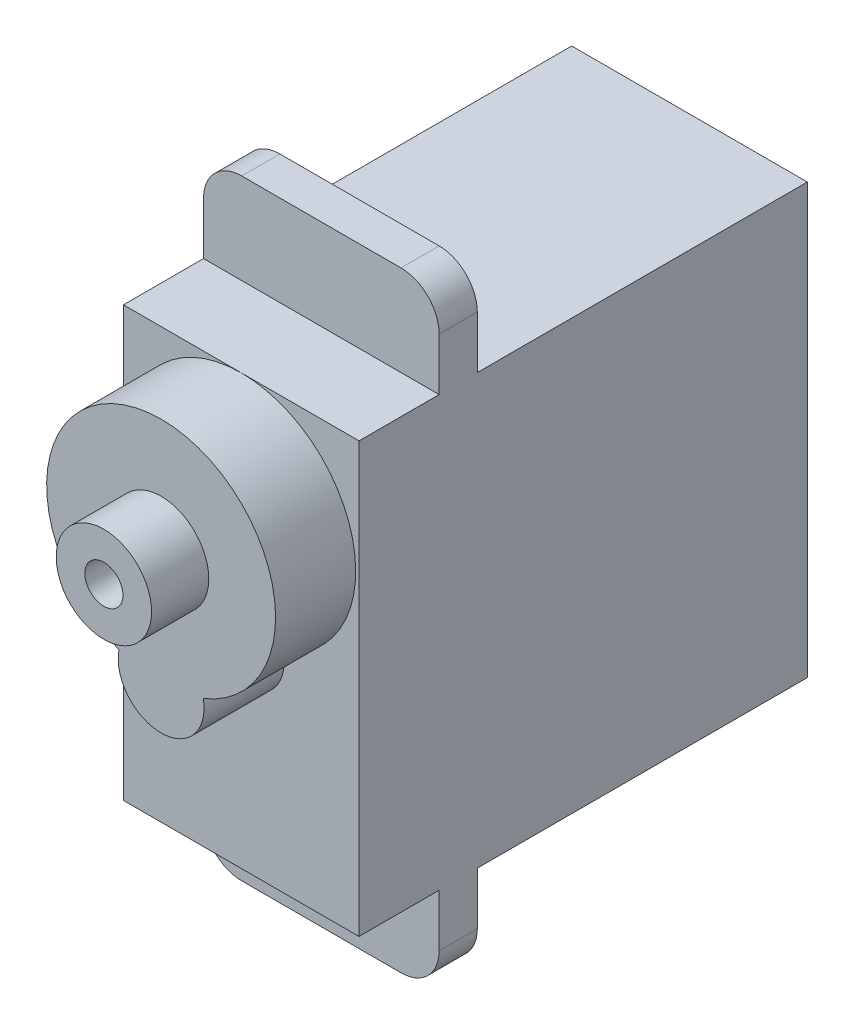
ISO-10303-21;
HEADER;
FILE_DESCRIPTION(('STEP AP214'),'2;1');
FILE_NAME('part.step','',(''),(''),'','','');
FILE_SCHEMA(('AUTOMOTIVE_DESIGN { 1 0 10303 214 1 1 1 1 }'));
ENDSEC;
DATA;
#1=APPLICATION_CONTEXT('core data for automotive mechanical design processes');
#2=APPLICATION_PROTOCOL_DEFINITION('international standard','automotive_design',2000,#1);
#3=PRODUCT_CONTEXT('',#1,'mechanical');
#4=PRODUCT('Part','Part','',(#3));
#5=PRODUCT_RELATED_PRODUCT_CATEGORY('part','',(#4));
#6=PRODUCT_DEFINITION_FORMATION('','',#4);
#7=PRODUCT_DEFINITION_CONTEXT('part definition',#1,'design');
#8=PRODUCT_DEFINITION('design','',#6,#7);
#9=PRODUCT_DEFINITION_SHAPE('','',#8);
#10=(LENGTH_UNIT() NAMED_UNIT(*) SI_UNIT(.MILLI.,.METRE.));
#11=(NAMED_UNIT(*) PLANE_ANGLE_UNIT() SI_UNIT($,.RADIAN.));
#12=(NAMED_UNIT(*) SI_UNIT($,.STERADIAN.) SOLID_ANGLE_UNIT());
#13=UNCERTAINTY_MEASURE_WITH_UNIT(LENGTH_MEASURE(1.E-05),#10,'distance_accuracy_value','');
#14=(GEOMETRIC_REPRESENTATION_CONTEXT(3) GLOBAL_UNCERTAINTY_ASSIGNED_CONTEXT((#13)) GLOBAL_UNIT_ASSIGNED_CONTEXT((#10,
#11,#12)) REPRESENTATION_CONTEXT('',''));
#15=CARTESIAN_POINT('',(0.,0.,0.));
#16=DIRECTION('',(0.,0.,1.));
#17=DIRECTION('',(1.,0.,0.));
#18=AXIS2_PLACEMENT_3D('',#15,#16,#17);
#19=CARTESIAN_POINT('',(6.175,7.58418091123829,178.866706922271));
#20=DIRECTION('',(0.,-1.,0.));
#21=DIRECTION('',(0.,0.,-1.));
#22=AXIS2_PLACEMENT_3D('',#19,#20,#21);
#23=PLANE('',#22);
#24=DIRECTION('',(-1.,0.,0.));
#25=VECTOR('',#24,1.);
#26=CARTESIAN_POINT('',(6.175,7.58418091123829,172.666706922271));
#27=LINE('',#26,#25);
#28=CARTESIAN_POINT('',(6.175,7.5841809112383,172.666706922271));
#29=VERTEX_POINT('',#28);
#30=CARTESIAN_POINT('',(-6.175,7.5841809112383,172.666706922271));
#31=VERTEX_POINT('',#30);
#32=EDGE_CURVE('E230',#29,#31,#27,.T.);
#33=ORIENTED_EDGE('',*,*,#32,.F.);
#34=DIRECTION('',(0.,0.,1.));
#35=VECTOR('',#34,1.);
#36=CARTESIAN_POINT('',(6.175,7.58418091123829,178.866706922271));
#37=LINE('',#36,#35);
#38=CARTESIAN_POINT('',(6.175,7.5841809112383,155.366706922271));
#39=VERTEX_POINT('',#38);
#40=EDGE_CURVE('E234',#39,#29,#37,.T.);
#41=ORIENTED_EDGE('',*,*,#40,.F.);
#42=DIRECTION('',(-1.,0.,0.));
#43=VECTOR('',#42,1.);
#44=CARTESIAN_POINT('',(6.175,7.5841809112383,155.366706922271));
#45=LINE('',#44,#43);
#46=CARTESIAN_POINT('',(-6.175,7.5841809112383,155.366706922271));
#47=VERTEX_POINT('',#46);
#48=EDGE_CURVE('E247',#39,#47,#45,.T.);
#49=ORIENTED_EDGE('',*,*,#48,.T.);
#50=DIRECTION('',(0.,0.,1.));
#51=VECTOR('',#50,1.);
#52=CARTESIAN_POINT('',(-6.175,7.58418091123829,178.866706922271));
#53=LINE('',#52,#51);
#54=EDGE_CURVE('E248',#47,#31,#53,.T.);
#55=ORIENTED_EDGE('',*,*,#54,.T.);
#56=EDGE_LOOP('',(#33,#41,#49,#55));
#57=FACE_BOUND('',#56,.T.);
#58=ADVANCED_FACE('F40',(#57),#23,.F.);
#59=CARTESIAN_POINT('',(6.175,-14.9158190887617,178.866706922271));
#60=DIRECTION('',(0.,1.,0.));
#61=DIRECTION('',(0.,0.,1.));
#62=AXIS2_PLACEMENT_3D('',#59,#60,#61);
#63=PLANE('',#62);
#64=DIRECTION('',(1.,0.,0.));
#65=VECTOR('',#64,1.);
#66=CARTESIAN_POINT('',(6.175,-14.9158190887617,172.666706922271));
#67=LINE('',#66,#65);
#68=CARTESIAN_POINT('',(-6.175,-14.9158190887617,172.666706922271));
#69=VERTEX_POINT('',#68);
#70=CARTESIAN_POINT('',(6.175,-14.9158190887617,172.666706922271));
#71=VERTEX_POINT('',#70);
#72=EDGE_CURVE('E227',#69,#71,#67,.T.);
#73=ORIENTED_EDGE('',*,*,#72,.F.);
#74=DIRECTION('',(0.,0.,-1.));
#75=VECTOR('',#74,1.);
#76=CARTESIAN_POINT('',(-6.175,-14.9158190887617,178.866706922271));
#77=LINE('',#76,#75);
#78=CARTESIAN_POINT('',(-6.175,-14.9158190887617,155.366706922271));
#79=VERTEX_POINT('',#78);
#80=EDGE_CURVE('E253',#69,#79,#77,.T.);
#81=ORIENTED_EDGE('',*,*,#80,.T.);
#82=DIRECTION('',(-1.,0.,0.));
#83=VECTOR('',#82,1.);
#84=CARTESIAN_POINT('',(6.175,-14.9158190887617,155.366706922271));
#85=LINE('',#84,#83);
#86=CARTESIAN_POINT('',(6.175,-14.9158190887617,155.366706922271));
#87=VERTEX_POINT('',#86);
#88=EDGE_CURVE('E262',#87,#79,#85,.T.);
#89=ORIENTED_EDGE('',*,*,#88,.F.);
#90=DIRECTION('',(0.,0.,-1.));
#91=VECTOR('',#90,1.);
#92=CARTESIAN_POINT('',(6.175,-14.9158190887617,178.866706922271));
#93=LINE('',#92,#91);
#94=EDGE_CURVE('E241',#71,#87,#93,.T.);
#95=ORIENTED_EDGE('',*,*,#94,.F.);
#96=EDGE_LOOP('',(#73,#81,#89,#95));
#97=FACE_BOUND('',#96,.T.);
#98=ADVANCED_FACE('F317',(#97),#63,.F.);
#99=CARTESIAN_POINT('',(6.175,7.5841809112383,174.666706922271));
#100=VERTEX_POINT('',#99);
#101=CARTESIAN_POINT('',(6.175,7.58418091123829,178.866706922271));
#102=VERTEX_POINT('',#101);
#103=EDGE_CURVE('E238',#100,#102,#37,.T.);
#104=ORIENTED_EDGE('',*,*,#103,.F.);
#105=DIRECTION('',(-1.,0.,0.));
#106=VECTOR('',#105,1.);
#107=CARTESIAN_POINT('',(6.175,7.58418091123829,174.666706922271));
#108=LINE('',#107,#106);
#109=CARTESIAN_POINT('',(-6.175,7.58418091123829,174.666706922271));
#110=VERTEX_POINT('',#109);
#111=EDGE_CURVE('E224',#100,#110,#108,.T.);
#112=ORIENTED_EDGE('',*,*,#111,.T.);
#113=CARTESIAN_POINT('',(-6.175,7.58418091123829,178.866706922271));
#114=VERTEX_POINT('',#113);
#115=EDGE_CURVE('E233',#110,#114,#53,.T.);
#116=ORIENTED_EDGE('',*,*,#115,.T.);
#117=DIRECTION('',(-1.,0.,0.));
#118=VECTOR('',#117,1.);
#119=CARTESIAN_POINT('',(6.175,7.58418091123829,178.866706922271));
#120=LINE('',#119,#118);
#121=CARTESIAN_POINT('',(0.,7.58418091123829,178.866706922271));
#122=VERTEX_POINT('',#121);
#123=EDGE_CURVE('E269',#122,#114,#120,.T.);
#124=ORIENTED_EDGE('',*,*,#123,.F.);
#125=EDGE_CURVE('E270',#102,#122,#120,.T.);
#126=ORIENTED_EDGE('',*,*,#125,.F.);
#127=EDGE_LOOP('',(#104,#112,#116,#124,#126));
#128=FACE_BOUND('',#127,.T.);
#129=ADVANCED_FACE('F334',(#128),#23,.F.);
#130=CARTESIAN_POINT('',(6.175,7.58418091123829,178.866706922271));
#131=DIRECTION('',(0.,0.,-1.));
#132=DIRECTION('',(-1.,0.,0.));
#133=AXIS2_PLACEMENT_3D('',#130,#131,#132);
#134=PLANE('',#133);
#135=CARTESIAN_POINT('',(0.,-4.41581908876171,178.866706922271));
#136=DIRECTION('',(0.,0.,1.));
#137=DIRECTION('',(1.,0.,0.));
#138=AXIS2_PLACEMENT_3D('',#135,#136,#137);
#139=CIRCLE('',#138,2.25);
#140=CARTESIAN_POINT('',(-2.21009535639868,-3.99394408876171,178.866706922271));
#141=VERTEX_POINT('',#140);
#142=CARTESIAN_POINT('',(2.21009535639868,-3.99394408876171,178.866706922271));
#143=VERTEX_POINT('',#142);
#144=EDGE_CURVE('E189',#141,#143,#139,.T.);
#145=ORIENTED_EDGE('',*,*,#144,.F.);
#146=CARTESIAN_POINT('',(0.,1.58418091123829,178.866706922271));
#147=DIRECTION('',(0.,0.,1.));
#148=DIRECTION('',(1.,0.,0.));
#149=AXIS2_PLACEMENT_3D('',#146,#147,#148);
#150=CIRCLE('',#149,6.);
#151=EDGE_CURVE('E273',#122,#141,#150,.T.);
#152=ORIENTED_EDGE('',*,*,#151,.F.);
#153=ORIENTED_EDGE('',*,*,#123,.T.);
#154=DIRECTION('',(0.,-1.,0.));
#155=VECTOR('',#154,1.);
#156=CARTESIAN_POINT('',(-6.175,7.58418091123829,178.866706922271));
#157=LINE('',#156,#155);
#158=CARTESIAN_POINT('',(-6.175,-14.9158190887617,178.866706922271));
#159=VERTEX_POINT('',#158);
#160=EDGE_CURVE('E251',#114,#159,#157,.T.);
#161=ORIENTED_EDGE('',*,*,#160,.T.);
#162=DIRECTION('',(-1.,0.,0.));
#163=VECTOR('',#162,1.);
#164=CARTESIAN_POINT('',(6.175,-14.9158190887617,178.866706922271));
#165=LINE('',#164,#163);
#166=CARTESIAN_POINT('',(6.175,-14.9158190887617,178.866706922271));
#167=VERTEX_POINT('',#166);
#168=EDGE_CURVE('E266',#167,#159,#165,.T.);
#169=ORIENTED_EDGE('',*,*,#168,.F.);
#170=DIRECTION('',(0.,-1.,0.));
#171=VECTOR('',#170,1.);
#172=CARTESIAN_POINT('',(6.175,7.58418091123829,178.866706922271));
#173=LINE('',#172,#171);
#174=EDGE_CURVE('E237',#102,#167,#173,.T.);
#175=ORIENTED_EDGE('',*,*,#174,.F.);
#176=ORIENTED_EDGE('',*,*,#125,.T.);
#177=EDGE_CURVE('E186',#143,#122,#150,.T.);
#178=ORIENTED_EDGE('',*,*,#177,.F.);
#179=EDGE_LOOP('',(#145,#152,#153,#161,#169,#175,#176,#178));
#180=FACE_BOUND('',#179,.T.);
#181=ADVANCED_FACE('F314',(#180),#134,.F.);
#182=CARTESIAN_POINT('',(-6.175,-14.9158190887617,174.666706922271));
#183=VERTEX_POINT('',#182);
#184=EDGE_CURVE('E254',#159,#183,#77,.T.);
#185=ORIENTED_EDGE('',*,*,#184,.T.);
#186=DIRECTION('',(1.,0.,0.));
#187=VECTOR('',#186,1.);
#188=CARTESIAN_POINT('',(6.175,-14.9158190887617,174.666706922271));
#189=LINE('',#188,#187);
#190=CARTESIAN_POINT('',(6.175,-14.9158190887617,174.666706922271));
#191=VERTEX_POINT('',#190);
#192=EDGE_CURVE('E208',#183,#191,#189,.T.);
#193=ORIENTED_EDGE('',*,*,#192,.T.);
#194=EDGE_CURVE('E242',#167,#191,#93,.T.);
#195=ORIENTED_EDGE('',*,*,#194,.F.);
#196=ORIENTED_EDGE('',*,*,#168,.T.);
#197=EDGE_LOOP('',(#185,#193,#195,#196));
#198=FACE_BOUND('',#197,.T.);
#199=ADVANCED_FACE('F309',(#198),#63,.F.);
#200=CARTESIAN_POINT('',(6.175,7.5841809112383,155.366706922271));
#201=DIRECTION('',(0.,0.,1.));
#202=DIRECTION('',(1.,0.,0.));
#203=AXIS2_PLACEMENT_3D('',#200,#201,#202);
#204=PLANE('',#203);
#205=DIRECTION('',(0.,1.,0.));
#206=VECTOR('',#205,1.);
#207=CARTESIAN_POINT('',(-6.175,7.5841809112383,155.366706922271));
#208=LINE('',#207,#206);
#209=EDGE_CURVE('E257',#79,#47,#208,.T.);
#210=ORIENTED_EDGE('',*,*,#209,.T.);
#211=ORIENTED_EDGE('',*,*,#48,.F.);
#212=DIRECTION('',(0.,1.,0.));
#213=VECTOR('',#212,1.);
#214=CARTESIAN_POINT('',(6.175,7.5841809112383,155.366706922271));
#215=LINE('',#214,#213);
#216=EDGE_CURVE('E245',#87,#39,#215,.T.);
#217=ORIENTED_EDGE('',*,*,#216,.F.);
#218=ORIENTED_EDGE('',*,*,#88,.T.);
#219=EDGE_LOOP('',(#210,#211,#217,#218));
#220=FACE_BOUND('',#219,.T.);
#221=ADVANCED_FACE('F313',(#220),#204,.F.);
#222=CARTESIAN_POINT('',(6.175,0.,0.));
#223=DIRECTION('',(-1.,0.,0.));
#224=DIRECTION('',(0.,0.,1.));
#225=AXIS2_PLACEMENT_3D('',#222,#223,#224);
#226=PLANE('',#225);
#227=DIRECTION('',(0.,1.,0.));
#228=VECTOR('',#227,1.);
#229=CARTESIAN_POINT('',(6.175,12.3341809112383,174.666706922271));
#230=LINE('',#229,#228);
#231=CARTESIAN_POINT('',(6.175,-17.6658190887617,174.666706922271));
#232=VERTEX_POINT('',#231);
#233=EDGE_CURVE('E216',#232,#191,#230,.T.);
#234=ORIENTED_EDGE('',*,*,#233,.F.);
#235=DIRECTION('',(0.,0.,1.));
#236=VECTOR('',#235,1.);
#237=CARTESIAN_POINT('',(6.175,-17.6658190887617,172.666706922271));
#238=LINE('',#237,#236);
#239=CARTESIAN_POINT('',(6.175,-17.6658190887617,172.666706922271));
#240=VERTEX_POINT('',#239);
#241=EDGE_CURVE('E286',#232,#240,#238,.F.);
#242=ORIENTED_EDGE('',*,*,#241,.T.);
#243=DIRECTION('',(0.,1.,0.));
#244=VECTOR('',#243,1.);
#245=CARTESIAN_POINT('',(6.175,12.3341809112383,172.666706922271));
#246=LINE('',#245,#244);
#247=EDGE_CURVE('E205',#240,#71,#246,.T.);
#248=ORIENTED_EDGE('',*,*,#247,.T.);
#249=ORIENTED_EDGE('',*,*,#94,.T.);
#250=ORIENTED_EDGE('',*,*,#216,.T.);
#251=ORIENTED_EDGE('',*,*,#40,.T.);
#252=CARTESIAN_POINT('',(6.175,10.3341809112383,172.666706922271));
#253=VERTEX_POINT('',#252);
#254=EDGE_CURVE('E204',#29,#253,#246,.T.);
#255=ORIENTED_EDGE('',*,*,#254,.T.);
#256=DIRECTION('',(0.,0.,1.));
#257=VECTOR('',#256,1.);
#258=CARTESIAN_POINT('',(6.175,10.3341809112383,174.666706922271));
#259=LINE('',#258,#257);
#260=CARTESIAN_POINT('',(6.175,10.3341809112383,174.666706922271));
#261=VERTEX_POINT('',#260);
#262=EDGE_CURVE('E283',#253,#261,#259,.T.);
#263=ORIENTED_EDGE('',*,*,#262,.T.);
#264=EDGE_CURVE('E215',#100,#261,#230,.T.);
#265=ORIENTED_EDGE('',*,*,#264,.F.);
#266=ORIENTED_EDGE('',*,*,#103,.T.);
#267=ORIENTED_EDGE('',*,*,#174,.T.);
#268=ORIENTED_EDGE('',*,*,#194,.T.);
#269=EDGE_LOOP('',(#234,#242,#248,#249,#250,#251,#255,#263,#265,#266,#267,#268));
#270=FACE_BOUND('',#269,.T.);
#271=ADVANCED_FACE('F351',(#270),#226,.F.);
#272=CARTESIAN_POINT('',(-6.175,0.,0.));
#273=DIRECTION('',(-1.,0.,0.));
#274=DIRECTION('',(0.,0.,1.));
#275=AXIS2_PLACEMENT_3D('',#272,#273,#274);
#276=PLANE('',#275);
#277=DIRECTION('',(0.,-1.,0.));
#278=VECTOR('',#277,1.);
#279=CARTESIAN_POINT('',(-6.175,12.3341809112383,172.666706922271));
#280=LINE('',#279,#278);
#281=CARTESIAN_POINT('',(-6.175,-17.6658190887617,172.666706922271));
#282=VERTEX_POINT('',#281);
#283=EDGE_CURVE('E201',#69,#282,#280,.T.);
#284=ORIENTED_EDGE('',*,*,#283,.T.);
#285=DIRECTION('',(0.,0.,1.));
#286=VECTOR('',#285,1.);
#287=CARTESIAN_POINT('',(-6.175,-17.6658190887617,0.));
#288=LINE('',#287,#286);
#289=CARTESIAN_POINT('',(-6.175,-17.6658190887617,174.666706922271));
#290=VERTEX_POINT('',#289);
#291=EDGE_CURVE('E294',#282,#290,#288,.T.);
#292=ORIENTED_EDGE('',*,*,#291,.T.);
#293=DIRECTION('',(0.,-1.,0.));
#294=VECTOR('',#293,1.);
#295=CARTESIAN_POINT('',(-6.175,12.3341809112383,174.666706922271));
#296=LINE('',#295,#294);
#297=EDGE_CURVE('E190',#183,#290,#296,.T.);
#298=ORIENTED_EDGE('',*,*,#297,.F.);
#299=ORIENTED_EDGE('',*,*,#184,.F.);
#300=ORIENTED_EDGE('',*,*,#160,.F.);
#301=ORIENTED_EDGE('',*,*,#115,.F.);
#302=CARTESIAN_POINT('',(-6.175,10.3341809112383,174.666706922271));
#303=VERTEX_POINT('',#302);
#304=EDGE_CURVE('E193',#303,#110,#296,.T.);
#305=ORIENTED_EDGE('',*,*,#304,.F.);
#306=DIRECTION('',(0.,0.,1.));
#307=VECTOR('',#306,1.);
#308=CARTESIAN_POINT('',(-6.175,10.3341809112383,0.));
#309=LINE('',#308,#307);
#310=CARTESIAN_POINT('',(-6.175,10.3341809112383,172.666706922271));
#311=VERTEX_POINT('',#310);
#312=EDGE_CURVE('E292',#303,#311,#309,.F.);
#313=ORIENTED_EDGE('',*,*,#312,.T.);
#314=EDGE_CURVE('E198',#311,#31,#280,.T.);
#315=ORIENTED_EDGE('',*,*,#314,.T.);
#316=ORIENTED_EDGE('',*,*,#54,.F.);
#317=ORIENTED_EDGE('',*,*,#209,.F.);
#318=ORIENTED_EDGE('',*,*,#80,.F.);
#319=EDGE_LOOP('',(#284,#292,#298,#299,#300,#301,#305,#313,#315,#316,#317,#318));
#320=FACE_BOUND('',#319,.T.);
#321=ADVANCED_FACE('F355',(#320),#276,.T.);
#322=CARTESIAN_POINT('',(-6.175,-19.6658190887617,172.666706922271));
#323=DIRECTION('',(0.,-1.,0.));
#324=DIRECTION('',(1.,0.,0.));
#325=AXIS2_PLACEMENT_3D('',#322,#323,#324);
#326=PLANE('',#325);
#327=DIRECTION('',(1.,0.,0.));
#328=VECTOR('',#327,1.);
#329=CARTESIAN_POINT('',(-6.175,-19.6658190887617,172.666706922271));
#330=LINE('',#329,#328);
#331=CARTESIAN_POINT('',(-4.175,-19.6658190887617,172.666706922271));
#332=VERTEX_POINT('',#331);
#333=CARTESIAN_POINT('',(4.175,-19.6658190887617,172.666706922271));
#334=VERTEX_POINT('',#333);
#335=EDGE_CURVE('E200',#332,#334,#330,.T.);
#336=ORIENTED_EDGE('',*,*,#335,.T.);
#337=DIRECTION('',(0.,0.,1.));
#338=VECTOR('',#337,1.);
#339=CARTESIAN_POINT('',(4.175,-19.6658190887617,174.666706922271));
#340=LINE('',#339,#338);
#341=CARTESIAN_POINT('',(4.175,-19.6658190887617,174.666706922271));
#342=VERTEX_POINT('',#341);
#343=EDGE_CURVE('E276',#334,#342,#340,.T.);
#344=ORIENTED_EDGE('',*,*,#343,.T.);
#345=DIRECTION('',(1.,0.,0.));
#346=VECTOR('',#345,1.);
#347=CARTESIAN_POINT('',(-6.175,-19.6658190887617,174.666706922271));
#348=LINE('',#347,#346);
#349=CARTESIAN_POINT('',(-4.175,-19.6658190887617,174.666706922271));
#350=VERTEX_POINT('',#349);
#351=EDGE_CURVE('E211',#350,#342,#348,.T.);
#352=ORIENTED_EDGE('',*,*,#351,.F.);
#353=DIRECTION('',(0.,0.,1.));
#354=VECTOR('',#353,1.);
#355=CARTESIAN_POINT('',(-4.175,-19.6658190887617,172.666706922271));
#356=LINE('',#355,#354);
#357=EDGE_CURVE('E274',#350,#332,#356,.F.);
#358=ORIENTED_EDGE('',*,*,#357,.T.);
#359=EDGE_LOOP('',(#336,#344,#352,#358));
#360=FACE_BOUND('',#359,.T.);
#361=ADVANCED_FACE('F375',(#360),#326,.T.);
#362=CARTESIAN_POINT('',(0.,0.,172.666706922271));
#363=DIRECTION('',(0.,0.,1.));
#364=DIRECTION('',(1.,0.,0.));
#365=AXIS2_PLACEMENT_3D('',#362,#363,#364);
#366=PLANE('',#365);
#367=ORIENTED_EDGE('',*,*,#247,.F.);
#368=CARTESIAN_POINT('',(4.175,-17.6658190887617,172.666706922271));
#369=DIRECTION('',(0.,0.,1.));
#370=DIRECTION('',(1.,0.,0.));
#371=AXIS2_PLACEMENT_3D('',#368,#369,#370);
#372=CIRCLE('',#371,2.);
#373=EDGE_CURVE('E290',#240,#334,#372,.F.);
#374=ORIENTED_EDGE('',*,*,#373,.T.);
#375=ORIENTED_EDGE('',*,*,#335,.F.);
#376=CARTESIAN_POINT('',(-4.175,-17.6658190887617,172.666706922271));
#377=DIRECTION('',(0.,0.,1.));
#378=DIRECTION('',(1.,0.,0.));
#379=AXIS2_PLACEMENT_3D('',#376,#377,#378);
#380=CIRCLE('',#379,2.);
#381=EDGE_CURVE('E288',#332,#282,#380,.F.);
#382=ORIENTED_EDGE('',*,*,#381,.T.);
#383=ORIENTED_EDGE('',*,*,#283,.F.);
#384=ORIENTED_EDGE('',*,*,#72,.T.);
#385=EDGE_LOOP('',(#367,#374,#375,#382,#383,#384));
#386=FACE_BOUND('',#385,.T.);
#387=ADVANCED_FACE('F369',(#386),#366,.F.);
#388=CARTESIAN_POINT('',(0.,0.,174.666706922271));
#389=DIRECTION('',(0.,0.,1.));
#390=DIRECTION('',(1.,0.,0.));
#391=AXIS2_PLACEMENT_3D('',#388,#389,#390);
#392=PLANE('',#391);
#393=ORIENTED_EDGE('',*,*,#351,.T.);
#394=CARTESIAN_POINT('',(4.175,-17.6658190887617,174.666706922271));
#395=DIRECTION('',(0.,0.,1.));
#396=DIRECTION('',(1.,0.,0.));
#397=AXIS2_PLACEMENT_3D('',#394,#395,#396);
#398=CIRCLE('',#397,2.);
#399=EDGE_CURVE('E281',#342,#232,#398,.T.);
#400=ORIENTED_EDGE('',*,*,#399,.T.);
#401=ORIENTED_EDGE('',*,*,#233,.T.);
#402=ORIENTED_EDGE('',*,*,#192,.F.);
#403=ORIENTED_EDGE('',*,*,#297,.T.);
#404=CARTESIAN_POINT('',(-4.175,-17.6658190887617,174.666706922271));
#405=DIRECTION('',(0.,0.,1.));
#406=DIRECTION('',(1.,0.,0.));
#407=AXIS2_PLACEMENT_3D('',#404,#405,#406);
#408=CIRCLE('',#407,2.);
#409=EDGE_CURVE('E279',#290,#350,#408,.T.);
#410=ORIENTED_EDGE('',*,*,#409,.T.);
#411=EDGE_LOOP('',(#393,#400,#401,#402,#403,#410));
#412=FACE_BOUND('',#411,.T.);
#413=ADVANCED_FACE('F374',(#412),#392,.T.);
#414=DIRECTION('',(-1.,0.,0.));
#415=VECTOR('',#414,1.);
#416=CARTESIAN_POINT('',(-6.175,12.3341809112383,172.666706922271));
#417=LINE('',#416,#415);
#418=CARTESIAN_POINT('',(4.175,12.3341809112383,172.666706922271));
#419=VERTEX_POINT('',#418);
#420=CARTESIAN_POINT('',(-4.175,12.3341809112383,172.666706922271));
#421=VERTEX_POINT('',#420);
#422=EDGE_CURVE('E207',#419,#421,#417,.T.);
#423=ORIENTED_EDGE('',*,*,#422,.F.);
#424=CARTESIAN_POINT('',(4.175,10.3341809112383,172.666706922271));
#425=DIRECTION('',(0.,0.,1.));
#426=DIRECTION('',(1.,0.,0.));
#427=AXIS2_PLACEMENT_3D('',#424,#425,#426);
#428=CIRCLE('',#427,2.);
#429=EDGE_CURVE('E11',#419,#253,#428,.F.);
#430=ORIENTED_EDGE('',*,*,#429,.T.);
#431=ORIENTED_EDGE('',*,*,#254,.F.);
#432=ORIENTED_EDGE('',*,*,#32,.T.);
#433=ORIENTED_EDGE('',*,*,#314,.F.);
#434=CARTESIAN_POINT('',(-4.175,10.3341809112383,172.666706922271));
#435=DIRECTION('',(0.,0.,1.));
#436=DIRECTION('',(1.,0.,0.));
#437=AXIS2_PLACEMENT_3D('',#434,#435,#436);
#438=CIRCLE('',#437,2.);
#439=EDGE_CURVE('E48',#311,#421,#438,.F.);
#440=ORIENTED_EDGE('',*,*,#439,.T.);
#441=EDGE_LOOP('',(#423,#430,#431,#432,#433,#440));
#442=FACE_BOUND('',#441,.T.);
#443=ADVANCED_FACE('F378',(#442),#366,.F.);
#444=ORIENTED_EDGE('',*,*,#264,.T.);
#445=CARTESIAN_POINT('',(4.175,10.3341809112383,174.666706922271));
#446=DIRECTION('',(0.,0.,1.));
#447=DIRECTION('',(1.,0.,0.));
#448=AXIS2_PLACEMENT_3D('',#445,#446,#447);
#449=CIRCLE('',#448,2.);
#450=CARTESIAN_POINT('',(4.175,12.3341809112383,174.666706922271));
#451=VERTEX_POINT('',#450);
#452=EDGE_CURVE('E299',#261,#451,#449,.T.);
#453=ORIENTED_EDGE('',*,*,#452,.T.);
#454=DIRECTION('',(-1.,0.,0.));
#455=VECTOR('',#454,1.);
#456=CARTESIAN_POINT('',(-6.175,12.3341809112383,174.666706922271));
#457=LINE('',#456,#455);
#458=CARTESIAN_POINT('',(-4.175,12.3341809112383,174.666706922271));
#459=VERTEX_POINT('',#458);
#460=EDGE_CURVE('E218',#451,#459,#457,.T.);
#461=ORIENTED_EDGE('',*,*,#460,.T.);
#462=CARTESIAN_POINT('',(-4.175,10.3341809112383,174.666706922271));
#463=DIRECTION('',(0.,0.,1.));
#464=DIRECTION('',(1.,0.,0.));
#465=AXIS2_PLACEMENT_3D('',#462,#463,#464);
#466=CIRCLE('',#465,2.);
#467=EDGE_CURVE('E297',#459,#303,#466,.T.);
#468=ORIENTED_EDGE('',*,*,#467,.T.);
#469=ORIENTED_EDGE('',*,*,#304,.T.);
#470=ORIENTED_EDGE('',*,*,#111,.F.);
#471=EDGE_LOOP('',(#444,#453,#461,#468,#469,#470));
#472=FACE_BOUND('',#471,.T.);
#473=ADVANCED_FACE('F386',(#472),#392,.T.);
#474=CARTESIAN_POINT('',(-6.175,12.3341809112383,172.666706922271));
#475=DIRECTION('',(0.,1.,0.));
#476=DIRECTION('',(0.,0.,1.));
#477=AXIS2_PLACEMENT_3D('',#474,#475,#476);
#478=PLANE('',#477);
#479=ORIENTED_EDGE('',*,*,#460,.F.);
#480=DIRECTION('',(0.,0.,1.));
#481=VECTOR('',#480,1.);
#482=CARTESIAN_POINT('',(4.175,12.3341809112383,172.666706922271));
#483=LINE('',#482,#481);
#484=EDGE_CURVE('E61',#451,#419,#483,.F.);
#485=ORIENTED_EDGE('',*,*,#484,.T.);
#486=ORIENTED_EDGE('',*,*,#422,.T.);
#487=DIRECTION('',(0.,0.,1.));
#488=VECTOR('',#487,1.);
#489=CARTESIAN_POINT('',(-4.175,12.3341809112383,172.666706922271));
#490=LINE('',#489,#488);
#491=EDGE_CURVE('E302',#421,#459,#490,.T.);
#492=ORIENTED_EDGE('',*,*,#491,.T.);
#493=EDGE_LOOP('',(#479,#485,#486,#492));
#494=FACE_BOUND('',#493,.T.);
#495=ADVANCED_FACE('F391',(#494),#478,.T.);
#496=CARTESIAN_POINT('',(0.,-4.41581908876171,183.066706922271));
#497=DIRECTION('',(0.,0.,-1.));
#498=DIRECTION('',(-1.,0.,0.));
#499=AXIS2_PLACEMENT_3D('',#496,#497,#498);
#500=CYLINDRICAL_SURFACE('',#499,2.25);
#501=ORIENTED_EDGE('',*,*,#144,.T.);
#502=DIRECTION('',(0.,0.,-1.));
#503=VECTOR('',#502,1.);
#504=CARTESIAN_POINT('',(2.21009535639868,-3.99394408876171,183.066706922271));
#505=LINE('',#504,#503);
#506=CARTESIAN_POINT('',(2.21009535639868,-3.99394408876171,183.066706922271));
#507=VERTEX_POINT('',#506);
#508=EDGE_CURVE('E173',#507,#143,#505,.T.);
#509=ORIENTED_EDGE('',*,*,#508,.F.);
#510=CARTESIAN_POINT('',(0.,-4.41581908876171,183.066706922271));
#511=DIRECTION('',(0.,0.,1.));
#512=DIRECTION('',(1.,0.,0.));
#513=AXIS2_PLACEMENT_3D('',#510,#511,#512);
#514=CIRCLE('',#513,2.25);
#515=CARTESIAN_POINT('',(-2.21009535639868,-3.99394408876171,183.066706922271));
#516=VERTEX_POINT('',#515);
#517=EDGE_CURVE('E181',#516,#507,#514,.T.);
#518=ORIENTED_EDGE('',*,*,#517,.F.);
#519=DIRECTION('',(0.,0.,-1.));
#520=VECTOR('',#519,1.);
#521=CARTESIAN_POINT('',(-2.21009535639868,-3.99394408876171,183.066706922271));
#522=LINE('',#521,#520);
#523=EDGE_CURVE('E177',#516,#141,#522,.T.);
#524=ORIENTED_EDGE('',*,*,#523,.T.);
#525=EDGE_LOOP('',(#501,#509,#518,#524));
#526=FACE_BOUND('',#525,.T.);
#527=ADVANCED_FACE('F188',(#526),#500,.T.);
#528=CARTESIAN_POINT('',(0.,1.58418091123829,183.066706922271));
#529=DIRECTION('',(0.,0.,-1.));
#530=DIRECTION('',(-1.,0.,0.));
#531=AXIS2_PLACEMENT_3D('',#528,#529,#530);
#532=CYLINDRICAL_SURFACE('',#531,6.);
#533=ORIENTED_EDGE('',*,*,#177,.T.);
#534=ORIENTED_EDGE('',*,*,#151,.T.);
#535=ORIENTED_EDGE('',*,*,#523,.F.);
#536=CARTESIAN_POINT('',(0.,1.58418091123829,183.066706922271));
#537=DIRECTION('',(0.,0.,1.));
#538=DIRECTION('',(1.,0.,0.));
#539=AXIS2_PLACEMENT_3D('',#536,#537,#538);
#540=CIRCLE('',#539,6.);
#541=EDGE_CURVE('E168',#507,#516,#540,.T.);
#542=ORIENTED_EDGE('',*,*,#541,.F.);
#543=ORIENTED_EDGE('',*,*,#508,.T.);
#544=EDGE_LOOP('',(#533,#534,#535,#542,#543));
#545=FACE_BOUND('',#544,.T.);
#546=ADVANCED_FACE('F171',(#545),#532,.T.);
#547=CARTESIAN_POINT('',(0.,-1.41581908876171,183.066706922271));
#548=DIRECTION('',(0.,0.,1.));
#549=DIRECTION('',(1.,0.,0.));
#550=AXIS2_PLACEMENT_3D('',#547,#548,#549);
#551=PLANE('',#550);
#552=CARTESIAN_POINT('',(0.,1.58418091123829,183.066706922271));
#553=DIRECTION('',(0.,0.,1.));
#554=DIRECTION('',(1.,0.,0.));
#555=AXIS2_PLACEMENT_3D('',#552,#553,#554);
#556=CIRCLE('',#555,2.5);
#557=CARTESIAN_POINT('',(2.5,1.58418091123829,183.066706922271));
#558=VERTEX_POINT('',#557);
#559=EDGE_CURVE('E414',#558,#558,#556,.T.);
#560=ORIENTED_EDGE('',*,*,#559,.F.);
#561=EDGE_LOOP('',(#560));
#562=FACE_BOUND('',#561,.T.);
#563=ORIENTED_EDGE('',*,*,#517,.T.);
#564=ORIENTED_EDGE('',*,*,#541,.T.);
#565=EDGE_LOOP('',(#563,#564));
#566=FACE_BOUND('',#565,.T.);
#567=ADVANCED_FACE('F183',(#562,#566),#551,.T.);
#568=CARTESIAN_POINT('',(4.175,-17.6658190887617,172.666706922271));
#569=DIRECTION('',(0.,0.,-1.));
#570=DIRECTION('',(-1.,0.,0.));
#571=AXIS2_PLACEMENT_3D('',#568,#569,#570);
#572=CYLINDRICAL_SURFACE('',#571,2.);
#573=ORIENTED_EDGE('',*,*,#373,.F.);
#574=ORIENTED_EDGE('',*,*,#241,.F.);
#575=ORIENTED_EDGE('',*,*,#399,.F.);
#576=ORIENTED_EDGE('',*,*,#343,.F.);
#577=EDGE_LOOP('',(#573,#574,#575,#576));
#578=FACE_BOUND('',#577,.T.);
#579=ADVANCED_FACE('F403',(#578),#572,.T.);
#580=CARTESIAN_POINT('',(-4.175,-17.6658190887617,0.));
#581=DIRECTION('',(0.,0.,1.));
#582=DIRECTION('',(1.,0.,0.));
#583=AXIS2_PLACEMENT_3D('',#580,#581,#582);
#584=CYLINDRICAL_SURFACE('',#583,2.);
#585=ORIENTED_EDGE('',*,*,#381,.F.);
#586=ORIENTED_EDGE('',*,*,#357,.F.);
#587=ORIENTED_EDGE('',*,*,#409,.F.);
#588=ORIENTED_EDGE('',*,*,#291,.F.);
#589=EDGE_LOOP('',(#585,#586,#587,#588));
#590=FACE_BOUND('',#589,.T.);
#591=ADVANCED_FACE('F562',(#590),#584,.T.);
#592=CARTESIAN_POINT('',(4.175,10.3341809112383,0.));
#593=DIRECTION('',(0.,0.,-1.));
#594=DIRECTION('',(-1.,0.,0.));
#595=AXIS2_PLACEMENT_3D('',#592,#593,#594);
#596=CYLINDRICAL_SURFACE('',#595,2.);
#597=ORIENTED_EDGE('',*,*,#429,.F.);
#598=ORIENTED_EDGE('',*,*,#484,.F.);
#599=ORIENTED_EDGE('',*,*,#452,.F.);
#600=ORIENTED_EDGE('',*,*,#262,.F.);
#601=EDGE_LOOP('',(#597,#598,#599,#600));
#602=FACE_BOUND('',#601,.T.);
#603=ADVANCED_FACE('F467',(#602),#596,.T.);
#604=CARTESIAN_POINT('',(-4.175,10.3341809112383,172.666706922271));
#605=DIRECTION('',(0.,0.,1.));
#606=DIRECTION('',(1.,0.,0.));
#607=AXIS2_PLACEMENT_3D('',#604,#605,#606);
#608=CYLINDRICAL_SURFACE('',#607,2.);
#609=ORIENTED_EDGE('',*,*,#439,.F.);
#610=ORIENTED_EDGE('',*,*,#312,.F.);
#611=ORIENTED_EDGE('',*,*,#467,.F.);
#612=ORIENTED_EDGE('',*,*,#491,.F.);
#613=EDGE_LOOP('',(#609,#610,#611,#612));
#614=FACE_BOUND('',#613,.T.);
#615=ADVANCED_FACE('F42',(#614),#608,.T.);
#616=CARTESIAN_POINT('',(0.,1.58418091123838,186.066706922271));
#617=DIRECTION('',(0.,0.,-1.));
#618=DIRECTION('',(-1.,0.,0.));
#619=AXIS2_PLACEMENT_3D('',#616,#617,#618);
#620=CYLINDRICAL_SURFACE('',#619,2.5);
#621=ORIENTED_EDGE('',*,*,#559,.T.);
#622=EDGE_LOOP('',(#621));
#623=FACE_BOUND('',#622,.T.);
#624=CARTESIAN_POINT('',(0.,1.58418091123838,186.066706922271));
#625=DIRECTION('',(0.,0.,1.));
#626=DIRECTION('',(1.,0.,0.));
#627=AXIS2_PLACEMENT_3D('',#624,#625,#626);
#628=CIRCLE('',#627,2.5);
#629=CARTESIAN_POINT('',(2.50000000000005,1.58418091123838,186.066706922271));
#630=VERTEX_POINT('',#629);
#631=EDGE_CURVE('E417',#630,#630,#628,.T.);
#632=ORIENTED_EDGE('',*,*,#631,.F.);
#633=EDGE_LOOP('',(#632));
#634=FACE_BOUND('',#633,.T.);
#635=ADVANCED_FACE('F457',(#623,#634),#620,.T.);
#636=CARTESIAN_POINT('',(0.,1.58418091123838,186.066706922271));
#637=DIRECTION('',(0.,0.,1.));
#638=DIRECTION('',(1.,0.,0.));
#639=AXIS2_PLACEMENT_3D('',#636,#637,#638);
#640=PLANE('',#639);
#641=CARTESIAN_POINT('',(0.,1.58418091123838,186.066706922271));
#642=DIRECTION('',(0.,0.,1.));
#643=DIRECTION('',(1.,0.,0.));
#644=AXIS2_PLACEMENT_3D('',#641,#642,#643);
#645=CIRCLE('',#644,1.);
#646=CARTESIAN_POINT('',(1.00000000000005,1.58418091123838,186.066706922271));
#647=VERTEX_POINT('',#646);
#648=EDGE_CURVE('E440',#647,#647,#645,.T.);
#649=ORIENTED_EDGE('',*,*,#648,.F.);
#650=EDGE_LOOP('',(#649));
#651=FACE_BOUND('',#650,.T.);
#652=ORIENTED_EDGE('',*,*,#631,.T.);
#653=EDGE_LOOP('',(#652));
#654=FACE_BOUND('',#653,.T.);
#655=ADVANCED_FACE('F451',(#651,#654),#640,.T.);
#656=CARTESIAN_POINT('',(0.,1.58418091123838,179.066706922271));
#657=DIRECTION('',(0.,0.,1.));
#658=DIRECTION('',(1.,0.,0.));
#659=AXIS2_PLACEMENT_3D('',#656,#657,#658);
#660=CYLINDRICAL_SURFACE('',#659,1.);
#661=CARTESIAN_POINT('',(0.,1.58418091123838,179.066706922271));
#662=DIRECTION('',(0.,0.,1.));
#663=DIRECTION('',(1.,0.,0.));
#664=AXIS2_PLACEMENT_3D('',#661,#662,#663);
#665=CIRCLE('',#664,1.);
#666=CARTESIAN_POINT('',(1.00000000000005,1.58418091123838,179.066706922271));
#667=VERTEX_POINT('',#666);
#668=EDGE_CURVE('E439',#667,#667,#665,.T.);
#669=ORIENTED_EDGE('',*,*,#668,.F.);
#670=EDGE_LOOP('',(#669));
#671=FACE_BOUND('',#670,.T.);
#672=ORIENTED_EDGE('',*,*,#648,.T.);
#673=EDGE_LOOP('',(#672));
#674=FACE_BOUND('',#673,.T.);
#675=ADVANCED_FACE('F448',(#671,#674),#660,.F.);
#676=CARTESIAN_POINT('',(0.,1.58418091123838,179.066706922271));
#677=DIRECTION('',(0.,0.,1.));
#678=DIRECTION('',(1.,0.,0.));
#679=AXIS2_PLACEMENT_3D('',#676,#677,#678);
#680=PLANE('',#679);
#681=ORIENTED_EDGE('',*,*,#668,.T.);
#682=EDGE_LOOP('',(#681));
#683=FACE_BOUND('',#682,.T.);
#684=ADVANCED_FACE('F446',(#683),#680,.T.);
#685=CLOSED_SHELL('',(#58,#98,#129,#181,#199,#221,#271,#321,#361,#387,#413,#443,#473,#495,#527,
#546,#567,#579,#591,#603,#615,#635,#655,#675,#684));
#686=MANIFOLD_SOLID_BREP('B2',#685);
#687=ADVANCED_BREP_SHAPE_REPRESENTATION('',(#18,#686),#14);
#688=SHAPE_DEFINITION_REPRESENTATION(#9,#687);
ENDSEC;
END-ISO-10303-21;
